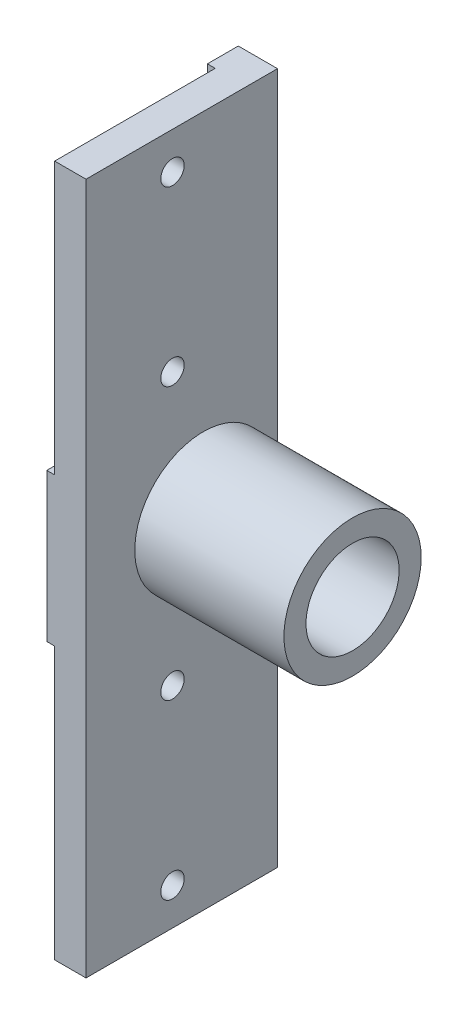
ISO-10303-21;
HEADER;
FILE_DESCRIPTION(('STEP AP214'),'2;1');
FILE_NAME('part.step','',(''),(''),'','','');
FILE_SCHEMA(('AUTOMOTIVE_DESIGN { 1 0 10303 214 1 1 1 1 }'));
ENDSEC;
DATA;
#1=APPLICATION_CONTEXT('core data for automotive mechanical design processes');
#2=APPLICATION_PROTOCOL_DEFINITION('international standard','automotive_design',2000,#1);
#3=PRODUCT_CONTEXT('',#1,'mechanical');
#4=PRODUCT('Part','Part','',(#3));
#5=PRODUCT_RELATED_PRODUCT_CATEGORY('part','',(#4));
#6=PRODUCT_DEFINITION_FORMATION('','',#4);
#7=PRODUCT_DEFINITION_CONTEXT('part definition',#1,'design');
#8=PRODUCT_DEFINITION('design','',#6,#7);
#9=PRODUCT_DEFINITION_SHAPE('','',#8);
#10=(LENGTH_UNIT() NAMED_UNIT(*) SI_UNIT(.MILLI.,.METRE.));
#11=(NAMED_UNIT(*) PLANE_ANGLE_UNIT() SI_UNIT($,.RADIAN.));
#12=(NAMED_UNIT(*) SI_UNIT($,.STERADIAN.) SOLID_ANGLE_UNIT());
#13=UNCERTAINTY_MEASURE_WITH_UNIT(LENGTH_MEASURE(1.E-05),#10,'distance_accuracy_value','');
#14=(GEOMETRIC_REPRESENTATION_CONTEXT(3) GLOBAL_UNCERTAINTY_ASSIGNED_CONTEXT((#13)) GLOBAL_UNIT_ASSIGNED_CONTEXT((#10,
#11,#12)) REPRESENTATION_CONTEXT('',''));
#15=CARTESIAN_POINT('',(0.,0.,0.));
#16=DIRECTION('',(0.,0.,1.));
#17=DIRECTION('',(1.,0.,0.));
#18=AXIS2_PLACEMENT_3D('',#15,#16,#17);
#19=CARTESIAN_POINT('',(1.27,0.,0.));
#20=DIRECTION('',(1.,0.,0.));
#21=DIRECTION('',(0.,0.,-1.));
#22=AXIS2_PLACEMENT_3D('',#19,#20,#21);
#23=PLANE('',#22);
#24=DIRECTION('',(0.,0.,1.));
#25=VECTOR('',#24,1.);
#26=CARTESIAN_POINT('',(1.27,-12.,19.));
#27=LINE('',#26,#25);
#28=CARTESIAN_POINT('',(1.27,-12.,-3.82499999999998));
#29=VERTEX_POINT('',#28);
#30=CARTESIAN_POINT('',(1.27,-12.,19.));
#31=VERTEX_POINT('',#30);
#32=EDGE_CURVE('E143',#29,#31,#27,.T.);
#33=ORIENTED_EDGE('',*,*,#32,.F.);
#34=CARTESIAN_POINT('',(1.27,-15.175,-3.82499999999999));
#35=DIRECTION('',(1.,0.,0.));
#36=DIRECTION('',(0.,0.,-1.));
#37=AXIS2_PLACEMENT_3D('',#34,#35,#36);
#38=CIRCLE('',#37,3.175);
#39=CARTESIAN_POINT('',(1.27,-15.175,-6.99999999999999));
#40=VERTEX_POINT('',#39);
#41=EDGE_CURVE('E44',#29,#40,#38,.F.);
#42=ORIENTED_EDGE('',*,*,#41,.T.);
#43=DIRECTION('',(0.,1.,0.));
#44=VECTOR('',#43,1.);
#45=CARTESIAN_POINT('',(1.27,-56.,-6.99999999999999));
#46=LINE('',#45,#44);
#47=CARTESIAN_POINT('',(1.27,-56.,-6.99999999999999));
#48=VERTEX_POINT('',#47);
#49=EDGE_CURVE('E130',#48,#40,#46,.T.);
#50=ORIENTED_EDGE('',*,*,#49,.F.);
#51=DIRECTION('',(0.,0.,-1.));
#52=VECTOR('',#51,1.);
#53=CARTESIAN_POINT('',(1.27,-56.,19.));
#54=LINE('',#53,#52);
#55=CARTESIAN_POINT('',(1.27000000000001,-56.,19.));
#56=VERTEX_POINT('',#55);
#57=EDGE_CURVE('E124',#56,#48,#54,.T.);
#58=ORIENTED_EDGE('',*,*,#57,.F.);
#59=DIRECTION('',(0.,-1.,0.));
#60=VECTOR('',#59,1.);
#61=CARTESIAN_POINT('',(1.27,-56.,19.));
#62=LINE('',#61,#60);
#63=EDGE_CURVE('E127',#31,#56,#62,.T.);
#64=ORIENTED_EDGE('',*,*,#63,.F.);
#65=EDGE_LOOP('',(#33,#42,#50,#58,#64));
#66=FACE_BOUND('',#65,.T.);
#67=CARTESIAN_POINT('',(1.27,-22.,5.));
#68=DIRECTION('',(-1.,0.,0.));
#69=DIRECTION('',(0.,0.,1.));
#70=AXIS2_PLACEMENT_3D('',#67,#68,#69);
#71=CIRCLE('',#70,1.89865);
#72=CARTESIAN_POINT('',(1.27,-22.,6.89865));
#73=VERTEX_POINT('',#72);
#74=EDGE_CURVE('E341',#73,#73,#71,.T.);
#75=ORIENTED_EDGE('',*,*,#74,.F.);
#76=EDGE_LOOP('',(#75));
#77=FACE_BOUND('',#76,.T.);
#78=CARTESIAN_POINT('',(1.27,-50.,5.));
#79=DIRECTION('',(-1.,0.,0.));
#80=DIRECTION('',(0.,0.,1.));
#81=AXIS2_PLACEMENT_3D('',#78,#79,#80);
#82=CIRCLE('',#81,1.89865);
#83=CARTESIAN_POINT('',(1.27,-50.,6.89865));
#84=VERTEX_POINT('',#83);
#85=EDGE_CURVE('E347',#84,#84,#82,.T.);
#86=ORIENTED_EDGE('',*,*,#85,.F.);
#87=EDGE_LOOP('',(#86));
#88=FACE_BOUND('',#87,.T.);
#89=ADVANCED_FACE('F36',(#66,#77,#88),#23,.F.);
#90=CARTESIAN_POINT('',(6.35,56.,19.));
#91=DIRECTION('',(0.,0.,-1.));
#92=DIRECTION('',(0.,1.,0.));
#93=AXIS2_PLACEMENT_3D('',#90,#91,#92);
#94=PLANE('',#93);
#95=DIRECTION('',(-1.,0.,0.));
#96=VECTOR('',#95,1.);
#97=CARTESIAN_POINT('',(57.4577293567226,-12.,19.));
#98=LINE('',#97,#96);
#99=CARTESIAN_POINT('',(0.,-12.,19.));
#100=VERTEX_POINT('',#99);
#101=EDGE_CURVE('E142',#31,#100,#98,.T.);
#102=ORIENTED_EDGE('',*,*,#101,.F.);
#103=ORIENTED_EDGE('',*,*,#63,.T.);
#104=DIRECTION('',(-1.,0.,0.));
#105=VECTOR('',#104,1.);
#106=CARTESIAN_POINT('',(6.35,-56.,19.));
#107=LINE('',#106,#105);
#108=CARTESIAN_POINT('',(6.35,-56.,19.));
#109=VERTEX_POINT('',#108);
#110=EDGE_CURVE('E138',#109,#56,#107,.T.);
#111=ORIENTED_EDGE('',*,*,#110,.F.);
#112=DIRECTION('',(0.,-1.,0.));
#113=VECTOR('',#112,1.);
#114=CARTESIAN_POINT('',(6.35,56.,19.));
#115=LINE('',#114,#113);
#116=CARTESIAN_POINT('',(6.35,56.,19.));
#117=VERTEX_POINT('',#116);
#118=EDGE_CURVE('E161',#117,#109,#115,.T.);
#119=ORIENTED_EDGE('',*,*,#118,.F.);
#120=DIRECTION('',(-1.,0.,0.));
#121=VECTOR('',#120,1.);
#122=CARTESIAN_POINT('',(6.35,56.,19.));
#123=LINE('',#122,#121);
#124=CARTESIAN_POINT('',(1.27,56.,19.));
#125=VERTEX_POINT('',#124);
#126=EDGE_CURVE('E174',#117,#125,#123,.T.);
#127=ORIENTED_EDGE('',*,*,#126,.T.);
#128=DIRECTION('',(0.,1.,0.));
#129=VECTOR('',#128,1.);
#130=CARTESIAN_POINT('',(1.27,56.,19.));
#131=LINE('',#130,#129);
#132=CARTESIAN_POINT('',(1.27,12.,19.));
#133=VERTEX_POINT('',#132);
#134=EDGE_CURVE('E278',#133,#125,#131,.T.);
#135=ORIENTED_EDGE('',*,*,#134,.F.);
#136=DIRECTION('',(-1.,0.,0.));
#137=VECTOR('',#136,1.);
#138=CARTESIAN_POINT('',(57.4577293567226,12.,19.));
#139=LINE('',#138,#137);
#140=CARTESIAN_POINT('',(0.,12.,19.));
#141=VERTEX_POINT('',#140);
#142=EDGE_CURVE('E275',#133,#141,#139,.T.);
#143=ORIENTED_EDGE('',*,*,#142,.T.);
#144=DIRECTION('',(0.,-1.,0.));
#145=VECTOR('',#144,1.);
#146=CARTESIAN_POINT('',(0.,56.,19.));
#147=LINE('',#146,#145);
#148=EDGE_CURVE('E169',#141,#100,#147,.T.);
#149=ORIENTED_EDGE('',*,*,#148,.T.);
#150=EDGE_LOOP('',(#102,#103,#111,#119,#127,#135,#143,#149));
#151=FACE_BOUND('',#150,.T.);
#152=ADVANCED_FACE('F137',(#151),#94,.F.);
#153=CARTESIAN_POINT('',(0.,0.,0.));
#154=DIRECTION('',(1.,0.,0.));
#155=DIRECTION('',(0.,0.,-1.));
#156=AXIS2_PLACEMENT_3D('',#153,#154,#155);
#157=PLANE('',#156);
#158=CARTESIAN_POINT('',(0.,0.,0.));
#159=DIRECTION('',(-1.,0.,0.));
#160=DIRECTION('',(0.,0.,1.));
#161=AXIS2_PLACEMENT_3D('',#158,#159,#160);
#162=CIRCLE('',#161,7.54126);
#163=CARTESIAN_POINT('',(0.,0.,7.54126));
#164=VERTEX_POINT('',#163);
#165=EDGE_CURVE('E291',#164,#164,#162,.T.);
#166=ORIENTED_EDGE('',*,*,#165,.F.);
#167=EDGE_LOOP('',(#166));
#168=FACE_BOUND('',#167,.T.);
#169=DIRECTION('',(0.,1.,0.));
#170=VECTOR('',#169,1.);
#171=CARTESIAN_POINT('',(0.,-56.,-6.99999999999999));
#172=LINE('',#171,#170);
#173=CARTESIAN_POINT('',(0.,-56.,-6.99999999999999));
#174=VERTEX_POINT('',#173);
#175=CARTESIAN_POINT('',(0.,-15.175,-6.99999999999999));
#176=VERTEX_POINT('',#175);
#177=EDGE_CURVE('E305',#174,#176,#172,.T.);
#178=ORIENTED_EDGE('',*,*,#177,.T.);
#179=CARTESIAN_POINT('',(0.,-15.175,-3.82499999999999));
#180=DIRECTION('',(1.,0.,0.));
#181=DIRECTION('',(0.,0.,-1.));
#182=AXIS2_PLACEMENT_3D('',#179,#180,#181);
#183=CIRCLE('',#182,3.175);
#184=CARTESIAN_POINT('',(0.,-12.,-3.82499999999998));
#185=VERTEX_POINT('',#184);
#186=EDGE_CURVE('E12',#176,#185,#183,.T.);
#187=ORIENTED_EDGE('',*,*,#186,.T.);
#188=DIRECTION('',(0.,0.,1.));
#189=VECTOR('',#188,1.);
#190=CARTESIAN_POINT('',(0.,-12.,19.));
#191=LINE('',#190,#189);
#192=EDGE_CURVE('E308',#185,#100,#191,.T.);
#193=ORIENTED_EDGE('',*,*,#192,.T.);
#194=ORIENTED_EDGE('',*,*,#148,.F.);
#195=DIRECTION('',(0.,0.,1.));
#196=VECTOR('',#195,1.);
#197=CARTESIAN_POINT('',(0.,12.,19.));
#198=LINE('',#197,#196);
#199=CARTESIAN_POINT('',(0.,12.,-3.82499999999998));
#200=VERTEX_POINT('',#199);
#201=EDGE_CURVE('E314',#200,#141,#198,.T.);
#202=ORIENTED_EDGE('',*,*,#201,.F.);
#203=CARTESIAN_POINT('',(0.,15.175,-3.82499999999998));
#204=DIRECTION('',(1.,0.,0.));
#205=DIRECTION('',(0.,0.,-1.));
#206=AXIS2_PLACEMENT_3D('',#203,#204,#205);
#207=CIRCLE('',#206,3.175);
#208=CARTESIAN_POINT('',(0.,15.175,-6.99999999999999));
#209=VERTEX_POINT('',#208);
#210=EDGE_CURVE('E184',#200,#209,#207,.T.);
#211=ORIENTED_EDGE('',*,*,#210,.T.);
#212=DIRECTION('',(0.,-1.,0.));
#213=VECTOR('',#212,1.);
#214=CARTESIAN_POINT('',(0.,56.,-6.99999999999999));
#215=LINE('',#214,#213);
#216=CARTESIAN_POINT('',(0.,56.,-6.99999999999999));
#217=VERTEX_POINT('',#216);
#218=EDGE_CURVE('E195',#217,#209,#215,.T.);
#219=ORIENTED_EDGE('',*,*,#218,.F.);
#220=DIRECTION('',(0.,0.,1.));
#221=VECTOR('',#220,1.);
#222=CARTESIAN_POINT('',(0.,56.,-12.));
#223=LINE('',#222,#221);
#224=CARTESIAN_POINT('',(0.,56.,-12.));
#225=VERTEX_POINT('',#224);
#226=EDGE_CURVE('E152',#225,#217,#223,.T.);
#227=ORIENTED_EDGE('',*,*,#226,.F.);
#228=DIRECTION('',(0.,1.,0.));
#229=VECTOR('',#228,1.);
#230=CARTESIAN_POINT('',(0.,0.,-12.));
#231=LINE('',#230,#229);
#232=CARTESIAN_POINT('',(0.,-56.,-12.));
#233=VERTEX_POINT('',#232);
#234=EDGE_CURVE('E162',#233,#225,#231,.T.);
#235=ORIENTED_EDGE('',*,*,#234,.F.);
#236=DIRECTION('',(0.,0.,1.));
#237=VECTOR('',#236,1.);
#238=CARTESIAN_POINT('',(0.,-56.,-12.));
#239=LINE('',#238,#237);
#240=EDGE_CURVE('E154',#233,#174,#239,.T.);
#241=ORIENTED_EDGE('',*,*,#240,.T.);
#242=EDGE_LOOP('',(#178,#187,#193,#194,#202,#211,#219,#227,#235,#241));
#243=FACE_BOUND('',#242,.T.);
#244=ADVANCED_FACE('F213',(#168,#243),#157,.F.);
#245=CARTESIAN_POINT('',(6.35,-56.,-12.));
#246=DIRECTION('',(0.,-1.,0.));
#247=DIRECTION('',(0.,0.,-1.));
#248=AXIS2_PLACEMENT_3D('',#245,#246,#247);
#249=PLANE('',#248);
#250=ORIENTED_EDGE('',*,*,#57,.T.);
#251=DIRECTION('',(-1.,0.,0.));
#252=VECTOR('',#251,1.);
#253=CARTESIAN_POINT('',(57.4577293567226,-56.,-6.99999999999999));
#254=LINE('',#253,#252);
#255=EDGE_CURVE('E194',#48,#174,#254,.T.);
#256=ORIENTED_EDGE('',*,*,#255,.T.);
#257=ORIENTED_EDGE('',*,*,#240,.F.);
#258=DIRECTION('',(-1.,0.,0.));
#259=VECTOR('',#258,1.);
#260=CARTESIAN_POINT('',(6.35,-56.,-12.));
#261=LINE('',#260,#259);
#262=CARTESIAN_POINT('',(6.35,-56.,-12.));
#263=VERTEX_POINT('',#262);
#264=EDGE_CURVE('E149',#263,#233,#261,.T.);
#265=ORIENTED_EDGE('',*,*,#264,.F.);
#266=DIRECTION('',(0.,0.,1.));
#267=VECTOR('',#266,1.);
#268=CARTESIAN_POINT('',(6.35,-56.,-12.));
#269=LINE('',#268,#267);
#270=EDGE_CURVE('E148',#263,#109,#269,.T.);
#271=ORIENTED_EDGE('',*,*,#270,.T.);
#272=ORIENTED_EDGE('',*,*,#110,.T.);
#273=EDGE_LOOP('',(#250,#256,#257,#265,#271,#272));
#274=FACE_BOUND('',#273,.T.);
#275=ADVANCED_FACE('F145',(#274),#249,.T.);
#276=CARTESIAN_POINT('',(6.35,0.,0.));
#277=DIRECTION('',(1.,0.,0.));
#278=DIRECTION('',(0.,0.,-1.));
#279=AXIS2_PLACEMENT_3D('',#276,#277,#278);
#280=PLANE('',#279);
#281=CARTESIAN_POINT('',(6.35,-50.,5.));
#282=DIRECTION('',(1.,0.,0.));
#283=DIRECTION('',(0.,0.,-1.));
#284=AXIS2_PLACEMENT_3D('',#281,#282,#283);
#285=CIRCLE('',#284,1.89865);
#286=CARTESIAN_POINT('',(6.35,-50.,3.10135));
#287=VERTEX_POINT('',#286);
#288=EDGE_CURVE('E344',#287,#287,#285,.T.);
#289=ORIENTED_EDGE('',*,*,#288,.F.);
#290=EDGE_LOOP('',(#289));
#291=FACE_BOUND('',#290,.T.);
#292=CARTESIAN_POINT('',(6.35,-22.,5.));
#293=DIRECTION('',(1.,0.,0.));
#294=DIRECTION('',(0.,0.,-1.));
#295=AXIS2_PLACEMENT_3D('',#292,#293,#294);
#296=CIRCLE('',#295,1.89865);
#297=CARTESIAN_POINT('',(6.35,-22.,3.10135000000001));
#298=VERTEX_POINT('',#297);
#299=EDGE_CURVE('E338',#298,#298,#296,.T.);
#300=ORIENTED_EDGE('',*,*,#299,.F.);
#301=EDGE_LOOP('',(#300));
#302=FACE_BOUND('',#301,.T.);
#303=CARTESIAN_POINT('',(6.35,50.,5.));
#304=DIRECTION('',(1.,0.,0.));
#305=DIRECTION('',(0.,0.,-1.));
#306=AXIS2_PLACEMENT_3D('',#303,#304,#305);
#307=CIRCLE('',#306,1.89865);
#308=CARTESIAN_POINT('',(6.35,50.,3.10135));
#309=VERTEX_POINT('',#308);
#310=EDGE_CURVE('E332',#309,#309,#307,.T.);
#311=ORIENTED_EDGE('',*,*,#310,.F.);
#312=EDGE_LOOP('',(#311));
#313=FACE_BOUND('',#312,.T.);
#314=CARTESIAN_POINT('',(6.35,22.,5.));
#315=DIRECTION('',(1.,0.,0.));
#316=DIRECTION('',(0.,0.,-1.));
#317=AXIS2_PLACEMENT_3D('',#314,#315,#316);
#318=CIRCLE('',#317,1.89865);
#319=CARTESIAN_POINT('',(6.35,22.,3.10135000000001));
#320=VERTEX_POINT('',#319);
#321=EDGE_CURVE('E310',#320,#320,#318,.T.);
#322=ORIENTED_EDGE('',*,*,#321,.F.);
#323=EDGE_LOOP('',(#322));
#324=FACE_BOUND('',#323,.T.);
#325=DIRECTION('',(0.,0.,1.));
#326=VECTOR('',#325,1.);
#327=CARTESIAN_POINT('',(6.35,56.,-12.));
#328=LINE('',#327,#326);
#329=CARTESIAN_POINT('',(6.35,56.,-12.));
#330=VERTEX_POINT('',#329);
#331=EDGE_CURVE('E158',#330,#117,#328,.T.);
#332=ORIENTED_EDGE('',*,*,#331,.T.);
#333=ORIENTED_EDGE('',*,*,#118,.T.);
#334=ORIENTED_EDGE('',*,*,#270,.F.);
#335=DIRECTION('',(0.,1.,0.));
#336=VECTOR('',#335,1.);
#337=CARTESIAN_POINT('',(6.35,0.,-12.));
#338=LINE('',#337,#336);
#339=EDGE_CURVE('E164',#263,#330,#338,.T.);
#340=ORIENTED_EDGE('',*,*,#339,.T.);
#341=EDGE_LOOP('',(#332,#333,#334,#340));
#342=FACE_BOUND('',#341,.T.);
#343=CARTESIAN_POINT('',(6.35,0.,0.));
#344=DIRECTION('',(1.,0.,0.));
#345=DIRECTION('',(0.,0.,-1.));
#346=AXIS2_PLACEMENT_3D('',#343,#344,#345);
#347=CIRCLE('',#346,11.1125);
#348=CARTESIAN_POINT('',(6.35,0.,-11.1125));
#349=VERTEX_POINT('',#348);
#350=EDGE_CURVE('E290',#349,#349,#347,.T.);
#351=ORIENTED_EDGE('',*,*,#350,.F.);
#352=EDGE_LOOP('',(#351));
#353=FACE_BOUND('',#352,.T.);
#354=ADVANCED_FACE('F245',(#291,#302,#313,#324,#342,#353),#280,.T.);
#355=CARTESIAN_POINT('',(6.35,56.,-12.));
#356=DIRECTION('',(0.,-1.,0.));
#357=DIRECTION('',(0.,0.,-1.));
#358=AXIS2_PLACEMENT_3D('',#355,#356,#357);
#359=PLANE('',#358);
#360=DIRECTION('',(-1.,0.,0.));
#361=VECTOR('',#360,1.);
#362=CARTESIAN_POINT('',(57.4577293567226,56.,-6.99999999999999));
#363=LINE('',#362,#361);
#364=CARTESIAN_POINT('',(1.27000000000001,56.,-6.99999999999999));
#365=VERTEX_POINT('',#364);
#366=EDGE_CURVE('E280',#365,#217,#363,.T.);
#367=ORIENTED_EDGE('',*,*,#366,.F.);
#368=DIRECTION('',(0.,0.,-1.));
#369=VECTOR('',#368,1.);
#370=CARTESIAN_POINT('',(1.27,56.,19.));
#371=LINE('',#370,#369);
#372=EDGE_CURVE('E286',#125,#365,#371,.T.);
#373=ORIENTED_EDGE('',*,*,#372,.F.);
#374=ORIENTED_EDGE('',*,*,#126,.F.);
#375=ORIENTED_EDGE('',*,*,#331,.F.);
#376=DIRECTION('',(-1.,0.,0.));
#377=VECTOR('',#376,1.);
#378=CARTESIAN_POINT('',(6.35,56.,-12.));
#379=LINE('',#378,#377);
#380=EDGE_CURVE('E166',#330,#225,#379,.T.);
#381=ORIENTED_EDGE('',*,*,#380,.T.);
#382=ORIENTED_EDGE('',*,*,#226,.T.);
#383=EDGE_LOOP('',(#367,#373,#374,#375,#381,#382));
#384=FACE_BOUND('',#383,.T.);
#385=ADVANCED_FACE('F248',(#384),#359,.F.);
#386=CARTESIAN_POINT('',(6.35,0.,-12.));
#387=DIRECTION('',(0.,0.,1.));
#388=DIRECTION('',(1.,0.,0.));
#389=AXIS2_PLACEMENT_3D('',#386,#387,#388);
#390=PLANE('',#389);
#391=ORIENTED_EDGE('',*,*,#234,.T.);
#392=ORIENTED_EDGE('',*,*,#380,.F.);
#393=ORIENTED_EDGE('',*,*,#339,.F.);
#394=ORIENTED_EDGE('',*,*,#264,.T.);
#395=EDGE_LOOP('',(#391,#392,#393,#394));
#396=FACE_BOUND('',#395,.T.);
#397=ADVANCED_FACE('F241',(#396),#390,.F.);
#398=CARTESIAN_POINT('',(30.50253802,0.,0.));
#399=DIRECTION('',(-1.,0.,0.));
#400=DIRECTION('',(0.,0.,1.));
#401=AXIS2_PLACEMENT_3D('',#398,#399,#400);
#402=CYLINDRICAL_SURFACE('',#401,11.1125);
#403=CARTESIAN_POINT('',(30.50253802,0.,0.));
#404=DIRECTION('',(1.,0.,0.));
#405=DIRECTION('',(0.,0.,-1.));
#406=AXIS2_PLACEMENT_3D('',#403,#404,#405);
#407=CIRCLE('',#406,11.1125);
#408=CARTESIAN_POINT('',(30.50253802,0.,-11.1125));
#409=VERTEX_POINT('',#408);
#410=EDGE_CURVE('E294',#409,#409,#407,.T.);
#411=ORIENTED_EDGE('',*,*,#410,.F.);
#412=EDGE_LOOP('',(#411));
#413=FACE_BOUND('',#412,.T.);
#414=ORIENTED_EDGE('',*,*,#350,.T.);
#415=EDGE_LOOP('',(#414));
#416=FACE_BOUND('',#415,.T.);
#417=ADVANCED_FACE('F237',(#413,#416),#402,.T.);
#418=CARTESIAN_POINT('',(30.50253802,0.,0.));
#419=DIRECTION('',(1.,0.,0.));
#420=DIRECTION('',(0.,0.,-1.));
#421=AXIS2_PLACEMENT_3D('',#418,#419,#420);
#422=PLANE('',#421);
#423=CARTESIAN_POINT('',(30.50253802,0.,0.));
#424=DIRECTION('',(-1.,0.,0.));
#425=DIRECTION('',(0.,0.,1.));
#426=AXIS2_PLACEMENT_3D('',#423,#424,#425);
#427=CIRCLE('',#426,7.54126);
#428=CARTESIAN_POINT('',(30.50253802,0.,7.54126));
#429=VERTEX_POINT('',#428);
#430=EDGE_CURVE('E287',#429,#429,#427,.T.);
#431=ORIENTED_EDGE('',*,*,#430,.T.);
#432=EDGE_LOOP('',(#431));
#433=FACE_BOUND('',#432,.T.);
#434=ORIENTED_EDGE('',*,*,#410,.T.);
#435=EDGE_LOOP('',(#434));
#436=FACE_BOUND('',#435,.T.);
#437=ADVANCED_FACE('F233',(#433,#436),#422,.T.);
#438=CARTESIAN_POINT('',(30.50253802,0.,0.));
#439=DIRECTION('',(-1.,0.,0.));
#440=DIRECTION('',(0.,0.,1.));
#441=AXIS2_PLACEMENT_3D('',#438,#439,#440);
#442=CYLINDRICAL_SURFACE('',#441,7.54126);
#443=ORIENTED_EDGE('',*,*,#430,.F.);
#444=EDGE_LOOP('',(#443));
#445=FACE_BOUND('',#444,.T.);
#446=ORIENTED_EDGE('',*,*,#165,.T.);
#447=EDGE_LOOP('',(#446));
#448=FACE_BOUND('',#447,.T.);
#449=ADVANCED_FACE('F229',(#445,#448),#442,.F.);
#450=CARTESIAN_POINT('',(1.27,0.,0.));
#451=DIRECTION('',(1.,0.,0.));
#452=DIRECTION('',(0.,0.,-1.));
#453=AXIS2_PLACEMENT_3D('',#450,#451,#452);
#454=PLANE('',#453);
#455=CARTESIAN_POINT('',(1.27,50.,5.));
#456=DIRECTION('',(-1.,0.,0.));
#457=DIRECTION('',(0.,0.,1.));
#458=AXIS2_PLACEMENT_3D('',#455,#456,#457);
#459=CIRCLE('',#458,1.89865);
#460=CARTESIAN_POINT('',(1.27,50.,6.89865));
#461=VERTEX_POINT('',#460);
#462=EDGE_CURVE('E335',#461,#461,#459,.T.);
#463=ORIENTED_EDGE('',*,*,#462,.F.);
#464=EDGE_LOOP('',(#463));
#465=FACE_BOUND('',#464,.T.);
#466=CARTESIAN_POINT('',(1.27,22.,5.));
#467=DIRECTION('',(-1.,0.,0.));
#468=DIRECTION('',(0.,0.,1.));
#469=AXIS2_PLACEMENT_3D('',#466,#467,#468);
#470=CIRCLE('',#469,1.89865);
#471=CARTESIAN_POINT('',(1.27,22.,6.89865));
#472=VERTEX_POINT('',#471);
#473=EDGE_CURVE('E329',#472,#472,#470,.T.);
#474=ORIENTED_EDGE('',*,*,#473,.F.);
#475=EDGE_LOOP('',(#474));
#476=FACE_BOUND('',#475,.T.);
#477=DIRECTION('',(0.,-1.,0.));
#478=VECTOR('',#477,1.);
#479=CARTESIAN_POINT('',(1.27,56.,-6.99999999999999));
#480=LINE('',#479,#478);
#481=CARTESIAN_POINT('',(1.27,15.175,-6.99999999999999));
#482=VERTEX_POINT('',#481);
#483=EDGE_CURVE('E272',#365,#482,#480,.T.);
#484=ORIENTED_EDGE('',*,*,#483,.T.);
#485=CARTESIAN_POINT('',(1.27,15.175,-3.82499999999998));
#486=DIRECTION('',(1.,0.,0.));
#487=DIRECTION('',(0.,0.,-1.));
#488=AXIS2_PLACEMENT_3D('',#485,#486,#487);
#489=CIRCLE('',#488,3.175);
#490=CARTESIAN_POINT('',(1.27,12.,-3.82499999999998));
#491=VERTEX_POINT('',#490);
#492=EDGE_CURVE('E182',#482,#491,#489,.F.);
#493=ORIENTED_EDGE('',*,*,#492,.T.);
#494=DIRECTION('',(0.,0.,1.));
#495=VECTOR('',#494,1.);
#496=CARTESIAN_POINT('',(1.27,12.,19.));
#497=LINE('',#496,#495);
#498=EDGE_CURVE('E269',#491,#133,#497,.T.);
#499=ORIENTED_EDGE('',*,*,#498,.T.);
#500=ORIENTED_EDGE('',*,*,#134,.T.);
#501=ORIENTED_EDGE('',*,*,#372,.T.);
#502=EDGE_LOOP('',(#484,#493,#499,#500,#501));
#503=FACE_BOUND('',#502,.T.);
#504=ADVANCED_FACE('F225',(#465,#476,#503),#454,.F.);
#505=CARTESIAN_POINT('',(57.4577293567226,56.,-6.99999999999999));
#506=DIRECTION('',(0.,0.,-1.));
#507=DIRECTION('',(0.,1.,0.));
#508=AXIS2_PLACEMENT_3D('',#505,#506,#507);
#509=PLANE('',#508);
#510=ORIENTED_EDGE('',*,*,#218,.T.);
#511=DIRECTION('',(-1.,0.,0.));
#512=VECTOR('',#511,1.);
#513=CARTESIAN_POINT('',(1.27,15.175,-6.99999999999999));
#514=LINE('',#513,#512);
#515=EDGE_CURVE('E180',#209,#482,#514,.F.);
#516=ORIENTED_EDGE('',*,*,#515,.T.);
#517=ORIENTED_EDGE('',*,*,#483,.F.);
#518=ORIENTED_EDGE('',*,*,#366,.T.);
#519=EDGE_LOOP('',(#510,#516,#517,#518));
#520=FACE_BOUND('',#519,.T.);
#521=ADVANCED_FACE('F221',(#520),#509,.F.);
#522=CARTESIAN_POINT('',(57.4577293567226,12.,19.));
#523=DIRECTION('',(0.,-1.,0.));
#524=DIRECTION('',(0.,0.,-1.));
#525=AXIS2_PLACEMENT_3D('',#522,#523,#524);
#526=PLANE('',#525);
#527=ORIENTED_EDGE('',*,*,#498,.F.);
#528=DIRECTION('',(-1.,0.,0.));
#529=VECTOR('',#528,1.);
#530=CARTESIAN_POINT('',(0.,12.,-3.82499999999998));
#531=LINE('',#530,#529);
#532=EDGE_CURVE('E177',#491,#200,#531,.T.);
#533=ORIENTED_EDGE('',*,*,#532,.T.);
#534=ORIENTED_EDGE('',*,*,#201,.T.);
#535=ORIENTED_EDGE('',*,*,#142,.F.);
#536=EDGE_LOOP('',(#527,#533,#534,#535));
#537=FACE_BOUND('',#536,.T.);
#538=ADVANCED_FACE('F217',(#537),#526,.F.);
#539=CARTESIAN_POINT('',(57.4577293567226,15.175,-3.82499999999998));
#540=DIRECTION('',(1.,0.,0.));
#541=DIRECTION('',(0.,0.,-1.));
#542=AXIS2_PLACEMENT_3D('',#539,#540,#541);
#543=CYLINDRICAL_SURFACE('',#542,3.175);
#544=ORIENTED_EDGE('',*,*,#492,.F.);
#545=ORIENTED_EDGE('',*,*,#515,.F.);
#546=ORIENTED_EDGE('',*,*,#210,.F.);
#547=ORIENTED_EDGE('',*,*,#532,.F.);
#548=EDGE_LOOP('',(#544,#545,#546,#547));
#549=FACE_BOUND('',#548,.T.);
#550=ADVANCED_FACE('F220',(#549),#543,.F.);
#551=CARTESIAN_POINT('',(57.4577293567226,-56.,-6.99999999999999));
#552=DIRECTION('',(0.,0.,1.));
#553=DIRECTION('',(0.,-1.,0.));
#554=AXIS2_PLACEMENT_3D('',#551,#552,#553);
#555=PLANE('',#554);
#556=ORIENTED_EDGE('',*,*,#49,.T.);
#557=DIRECTION('',(-1.,0.,0.));
#558=VECTOR('',#557,1.);
#559=CARTESIAN_POINT('',(0.,-15.175,-6.99999999999999));
#560=LINE('',#559,#558);
#561=EDGE_CURVE('E186',#40,#176,#560,.T.);
#562=ORIENTED_EDGE('',*,*,#561,.T.);
#563=ORIENTED_EDGE('',*,*,#177,.F.);
#564=ORIENTED_EDGE('',*,*,#255,.F.);
#565=EDGE_LOOP('',(#556,#562,#563,#564));
#566=FACE_BOUND('',#565,.T.);
#567=ADVANCED_FACE('F193',(#566),#555,.T.);
#568=CARTESIAN_POINT('',(57.4577293567226,-12.,19.));
#569=DIRECTION('',(0.,-1.,0.));
#570=DIRECTION('',(0.,0.,-1.));
#571=AXIS2_PLACEMENT_3D('',#568,#569,#570);
#572=PLANE('',#571);
#573=ORIENTED_EDGE('',*,*,#192,.F.);
#574=DIRECTION('',(-1.,0.,0.));
#575=VECTOR('',#574,1.);
#576=CARTESIAN_POINT('',(1.27000000000001,-12.,-3.82499999999999));
#577=LINE('',#576,#575);
#578=EDGE_CURVE('E56',#185,#29,#577,.F.);
#579=ORIENTED_EDGE('',*,*,#578,.T.);
#580=ORIENTED_EDGE('',*,*,#32,.T.);
#581=ORIENTED_EDGE('',*,*,#101,.T.);
#582=EDGE_LOOP('',(#573,#579,#580,#581));
#583=FACE_BOUND('',#582,.T.);
#584=ADVANCED_FACE('F199',(#583),#572,.T.);
#585=CARTESIAN_POINT('',(57.4577293567226,-15.175,-3.82499999999999));
#586=DIRECTION('',(1.,0.,0.));
#587=DIRECTION('',(0.,0.,-1.));
#588=AXIS2_PLACEMENT_3D('',#585,#586,#587);
#589=CYLINDRICAL_SURFACE('',#588,3.175);
#590=ORIENTED_EDGE('',*,*,#41,.F.);
#591=ORIENTED_EDGE('',*,*,#578,.F.);
#592=ORIENTED_EDGE('',*,*,#186,.F.);
#593=ORIENTED_EDGE('',*,*,#561,.F.);
#594=EDGE_LOOP('',(#590,#591,#592,#593));
#595=FACE_BOUND('',#594,.T.);
#596=ADVANCED_FACE('F38',(#595),#589,.F.);
#597=CARTESIAN_POINT('',(1.27,22.,5.));
#598=DIRECTION('',(-1.,0.,0.));
#599=DIRECTION('',(0.,0.,1.));
#600=AXIS2_PLACEMENT_3D('',#597,#598,#599);
#601=CYLINDRICAL_SURFACE('',#600,1.89865);
#602=ORIENTED_EDGE('',*,*,#321,.T.);
#603=EDGE_LOOP('',(#602));
#604=FACE_BOUND('',#603,.T.);
#605=ORIENTED_EDGE('',*,*,#473,.T.);
#606=EDGE_LOOP('',(#605));
#607=FACE_BOUND('',#606,.T.);
#608=ADVANCED_FACE('F198',(#604,#607),#601,.F.);
#609=CARTESIAN_POINT('',(1.27,50.,5.));
#610=DIRECTION('',(-1.,0.,0.));
#611=DIRECTION('',(0.,0.,1.));
#612=AXIS2_PLACEMENT_3D('',#609,#610,#611);
#613=CYLINDRICAL_SURFACE('',#612,1.89865);
#614=ORIENTED_EDGE('',*,*,#310,.T.);
#615=EDGE_LOOP('',(#614));
#616=FACE_BOUND('',#615,.T.);
#617=ORIENTED_EDGE('',*,*,#462,.T.);
#618=EDGE_LOOP('',(#617));
#619=FACE_BOUND('',#618,.T.);
#620=ADVANCED_FACE('F204',(#616,#619),#613,.F.);
#621=CARTESIAN_POINT('',(1.27,-22.,5.));
#622=DIRECTION('',(-1.,0.,0.));
#623=DIRECTION('',(0.,0.,1.));
#624=AXIS2_PLACEMENT_3D('',#621,#622,#623);
#625=CYLINDRICAL_SURFACE('',#624,1.89865);
#626=ORIENTED_EDGE('',*,*,#299,.T.);
#627=EDGE_LOOP('',(#626));
#628=FACE_BOUND('',#627,.T.);
#629=ORIENTED_EDGE('',*,*,#74,.T.);
#630=EDGE_LOOP('',(#629));
#631=FACE_BOUND('',#630,.T.);
#632=ADVANCED_FACE('F354',(#628,#631),#625,.F.);
#633=CARTESIAN_POINT('',(1.27,-50.,5.));
#634=DIRECTION('',(-1.,0.,0.));
#635=DIRECTION('',(0.,0.,1.));
#636=AXIS2_PLACEMENT_3D('',#633,#634,#635);
#637=CYLINDRICAL_SURFACE('',#636,1.89865);
#638=ORIENTED_EDGE('',*,*,#288,.T.);
#639=EDGE_LOOP('',(#638));
#640=FACE_BOUND('',#639,.T.);
#641=ORIENTED_EDGE('',*,*,#85,.T.);
#642=EDGE_LOOP('',(#641));
#643=FACE_BOUND('',#642,.T.);
#644=ADVANCED_FACE('F351',(#640,#643),#637,.F.);
#645=CLOSED_SHELL('',(#89,#152,#244,#275,#354,#385,#397,#417,#437,#449,#504,#521,#538,#550,#567,
#584,#596,#608,#620,#632,#644));
#646=MANIFOLD_SOLID_BREP('B2',#645);
#647=ADVANCED_BREP_SHAPE_REPRESENTATION('',(#18,#646),#14);
#648=SHAPE_DEFINITION_REPRESENTATION(#9,#647);
ENDSEC;
END-ISO-10303-21;
